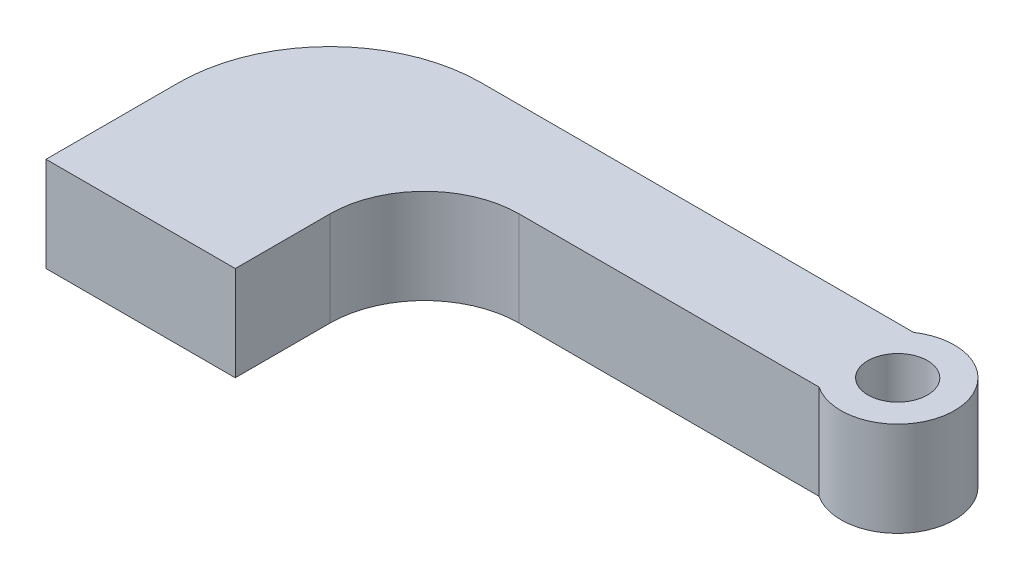
ISO-10303-21;
HEADER;
FILE_DESCRIPTION(('STEP AP214'),'2;1');
FILE_NAME('part.step','',(''),(''),'','','');
FILE_SCHEMA(('AUTOMOTIVE_DESIGN { 1 0 10303 214 1 1 1 1 }'));
ENDSEC;
DATA;
#1=APPLICATION_CONTEXT('core data for automotive mechanical design processes');
#2=APPLICATION_PROTOCOL_DEFINITION('international standard','automotive_design',2000,#1);
#3=PRODUCT_CONTEXT('',#1,'mechanical');
#4=PRODUCT('Part','Part','',(#3));
#5=PRODUCT_RELATED_PRODUCT_CATEGORY('part','',(#4));
#6=PRODUCT_DEFINITION_FORMATION('','',#4);
#7=PRODUCT_DEFINITION_CONTEXT('part definition',#1,'design');
#8=PRODUCT_DEFINITION('design','',#6,#7);
#9=PRODUCT_DEFINITION_SHAPE('','',#8);
#10=(LENGTH_UNIT() NAMED_UNIT(*) SI_UNIT(.MILLI.,.METRE.));
#11=(NAMED_UNIT(*) PLANE_ANGLE_UNIT() SI_UNIT($,.RADIAN.));
#12=(NAMED_UNIT(*) SI_UNIT($,.STERADIAN.) SOLID_ANGLE_UNIT());
#13=UNCERTAINTY_MEASURE_WITH_UNIT(LENGTH_MEASURE(1.E-05),#10,'distance_accuracy_value','');
#14=(GEOMETRIC_REPRESENTATION_CONTEXT(3) GLOBAL_UNCERTAINTY_ASSIGNED_CONTEXT((#13)) GLOBAL_UNIT_ASSIGNED_CONTEXT((#10,
#11,#12)) REPRESENTATION_CONTEXT('',''));
#15=CARTESIAN_POINT('',(0.,0.,0.));
#16=DIRECTION('',(0.,0.,1.));
#17=DIRECTION('',(1.,0.,0.));
#18=AXIS2_PLACEMENT_3D('',#15,#16,#17);
#19=CARTESIAN_POINT('',(10.16,6.35,-8.89));
#20=DIRECTION('',(0.,-1.,0.));
#21=DIRECTION('',(0.,0.,-1.));
#22=AXIS2_PLACEMENT_3D('',#19,#20,#21);
#23=PLANE('',#22);
#24=DIRECTION('',(0.,0.,1.));
#25=VECTOR('',#24,1.);
#26=CARTESIAN_POINT('',(0.,6.35,0.));
#27=LINE('',#26,#25);
#28=CARTESIAN_POINT('',(0.,6.35,-8.88999999999993));
#29=VERTEX_POINT('',#28);
#30=CARTESIAN_POINT('',(0.,6.35,0.));
#31=VERTEX_POINT('',#30);
#32=EDGE_CURVE('E145',#29,#31,#27,.T.);
#33=ORIENTED_EDGE('',*,*,#32,.T.);
#34=DIRECTION('',(1.,0.,0.));
#35=VECTOR('',#34,1.);
#36=CARTESIAN_POINT('',(0.,6.35,0.));
#37=LINE('',#36,#35);
#38=CARTESIAN_POINT('',(12.7,6.35,0.));
#39=VERTEX_POINT('',#38);
#40=EDGE_CURVE('E92',#31,#39,#37,.T.);
#41=ORIENTED_EDGE('',*,*,#40,.T.);
#42=DIRECTION('',(0.,0.,-1.));
#43=VECTOR('',#42,1.);
#44=CARTESIAN_POINT('',(12.7,6.35,0.));
#45=LINE('',#44,#43);
#46=CARTESIAN_POINT('',(12.7,6.35,-6.34999999999995));
#47=VERTEX_POINT('',#46);
#48=EDGE_CURVE('E160',#39,#47,#45,.T.);
#49=ORIENTED_EDGE('',*,*,#48,.T.);
#50=CARTESIAN_POINT('',(19.05,6.35,-6.35));
#51=DIRECTION('',(0.,-1.,0.));
#52=DIRECTION('',(0.,0.,1.));
#53=AXIS2_PLACEMENT_3D('',#50,#51,#52);
#54=CIRCLE('',#53,6.35);
#55=CARTESIAN_POINT('',(19.05,6.35,-12.7));
#56=VERTEX_POINT('',#55);
#57=EDGE_CURVE('E173',#47,#56,#54,.T.);
#58=ORIENTED_EDGE('',*,*,#57,.T.);
#59=DIRECTION('',(1.,0.,0.));
#60=VECTOR('',#59,1.);
#61=CARTESIAN_POINT('',(19.05,6.35,-12.7));
#62=LINE('',#61,#60);
#63=CARTESIAN_POINT('',(39.1688150039394,6.35,-12.7));
#64=VERTEX_POINT('',#63);
#65=EDGE_CURVE('E111',#56,#64,#62,.T.);
#66=ORIENTED_EDGE('',*,*,#65,.T.);
#67=CARTESIAN_POINT('',(41.275,6.35,-15.8749149220678));
#68=DIRECTION('',(0.,1.,0.));
#69=DIRECTION('',(0.,0.,1.));
#70=AXIS2_PLACEMENT_3D('',#67,#68,#69);
#71=CIRCLE('',#70,3.81);
#72=CARTESIAN_POINT('',(39.1690715235572,6.35,-19.05));
#73=VERTEX_POINT('',#72);
#74=EDGE_CURVE('E105',#64,#73,#71,.T.);
#75=ORIENTED_EDGE('',*,*,#74,.T.);
#76=DIRECTION('',(-1.,0.,0.));
#77=VECTOR('',#76,1.);
#78=CARTESIAN_POINT('',(12.7,6.35,-19.05));
#79=LINE('',#78,#77);
#80=CARTESIAN_POINT('',(10.1600000000001,6.35,-19.05));
#81=VERTEX_POINT('',#80);
#82=EDGE_CURVE('E109',#73,#81,#79,.T.);
#83=ORIENTED_EDGE('',*,*,#82,.T.);
#84=CARTESIAN_POINT('',(10.16,6.35,-8.89));
#85=DIRECTION('',(0.,1.,0.));
#86=DIRECTION('',(0.,0.,-1.));
#87=AXIS2_PLACEMENT_3D('',#84,#85,#86);
#88=CIRCLE('',#87,10.16);
#89=EDGE_CURVE('E50',#81,#29,#88,.T.);
#90=ORIENTED_EDGE('',*,*,#89,.T.);
#91=EDGE_LOOP('',(#33,#41,#49,#58,#66,#75,#83,#90));
#92=FACE_BOUND('',#91,.T.);
#93=CARTESIAN_POINT('',(41.275,6.35,-15.8749149220678));
#94=DIRECTION('',(0.,1.,0.));
#95=DIRECTION('',(0.,0.,1.));
#96=AXIS2_PLACEMENT_3D('',#93,#94,#95);
#97=CIRCLE('',#96,2.);
#98=CARTESIAN_POINT('',(41.275,6.35,-13.8749149220678));
#99=VERTEX_POINT('',#98);
#100=EDGE_CURVE('E134',#99,#99,#97,.T.);
#101=ORIENTED_EDGE('',*,*,#100,.F.);
#102=EDGE_LOOP('',(#101));
#103=FACE_BOUND('',#102,.T.);
#104=ADVANCED_FACE('F33',(#92,#103),#23,.F.);
#105=CARTESIAN_POINT('',(10.16,0.,-8.89));
#106=DIRECTION('',(0.,-1.,0.));
#107=DIRECTION('',(0.,0.,-1.));
#108=AXIS2_PLACEMENT_3D('',#105,#106,#107);
#109=PLANE('',#108);
#110=DIRECTION('',(0.,0.,1.));
#111=VECTOR('',#110,1.);
#112=CARTESIAN_POINT('',(0.,0.,0.));
#113=LINE('',#112,#111);
#114=CARTESIAN_POINT('',(0.,0.,-8.88999999999993));
#115=VERTEX_POINT('',#114);
#116=CARTESIAN_POINT('',(0.,0.,0.));
#117=VERTEX_POINT('',#116);
#118=EDGE_CURVE('E130',#115,#117,#113,.T.);
#119=ORIENTED_EDGE('',*,*,#118,.F.);
#120=CARTESIAN_POINT('',(10.16,0.,-8.89));
#121=DIRECTION('',(0.,1.,0.));
#122=DIRECTION('',(0.,0.,-1.));
#123=AXIS2_PLACEMENT_3D('',#120,#121,#122);
#124=CIRCLE('',#123,10.16);
#125=CARTESIAN_POINT('',(10.1600000000001,0.,-19.05));
#126=VERTEX_POINT('',#125);
#127=EDGE_CURVE('E84',#126,#115,#124,.T.);
#128=ORIENTED_EDGE('',*,*,#127,.F.);
#129=DIRECTION('',(-1.,0.,0.));
#130=VECTOR('',#129,1.);
#131=CARTESIAN_POINT('',(10.1600000000001,0.,-19.05));
#132=LINE('',#131,#130);
#133=CARTESIAN_POINT('',(39.1690715235572,0.,-19.05));
#134=VERTEX_POINT('',#133);
#135=EDGE_CURVE('E78',#134,#126,#132,.T.);
#136=ORIENTED_EDGE('',*,*,#135,.F.);
#137=CARTESIAN_POINT('',(41.275,0.,-15.8749149220678));
#138=DIRECTION('',(0.,1.,0.));
#139=DIRECTION('',(0.,0.,1.));
#140=AXIS2_PLACEMENT_3D('',#137,#138,#139);
#141=CIRCLE('',#140,3.81);
#142=CARTESIAN_POINT('',(39.1688150039394,0.,-12.7));
#143=VERTEX_POINT('',#142);
#144=EDGE_CURVE('E120',#143,#134,#141,.T.);
#145=ORIENTED_EDGE('',*,*,#144,.F.);
#146=DIRECTION('',(1.,0.,0.));
#147=VECTOR('',#146,1.);
#148=CARTESIAN_POINT('',(19.05,0.,-12.7));
#149=LINE('',#148,#147);
#150=CARTESIAN_POINT('',(19.05,0.,-12.7));
#151=VERTEX_POINT('',#150);
#152=EDGE_CURVE('E140',#151,#143,#149,.T.);
#153=ORIENTED_EDGE('',*,*,#152,.F.);
#154=CARTESIAN_POINT('',(19.05,0.,-6.35));
#155=DIRECTION('',(0.,-1.,0.));
#156=DIRECTION('',(0.,0.,1.));
#157=AXIS2_PLACEMENT_3D('',#154,#155,#156);
#158=CIRCLE('',#157,6.35);
#159=CARTESIAN_POINT('',(12.7,0.,-6.34999999999995));
#160=VERTEX_POINT('',#159);
#161=EDGE_CURVE('E138',#160,#151,#158,.T.);
#162=ORIENTED_EDGE('',*,*,#161,.F.);
#163=DIRECTION('',(0.,0.,-1.));
#164=VECTOR('',#163,1.);
#165=CARTESIAN_POINT('',(12.7,0.,0.));
#166=LINE('',#165,#164);
#167=CARTESIAN_POINT('',(12.7,0.,0.));
#168=VERTEX_POINT('',#167);
#169=EDGE_CURVE('E136',#168,#160,#166,.T.);
#170=ORIENTED_EDGE('',*,*,#169,.F.);
#171=DIRECTION('',(1.,0.,0.));
#172=VECTOR('',#171,1.);
#173=CARTESIAN_POINT('',(0.,0.,0.));
#174=LINE('',#173,#172);
#175=EDGE_CURVE('E133',#117,#168,#174,.T.);
#176=ORIENTED_EDGE('',*,*,#175,.F.);
#177=EDGE_LOOP('',(#119,#128,#136,#145,#153,#162,#170,#176));
#178=FACE_BOUND('',#177,.T.);
#179=CARTESIAN_POINT('',(41.275,0.,-15.8749149220678));
#180=DIRECTION('',(0.,1.,0.));
#181=DIRECTION('',(0.,0.,1.));
#182=AXIS2_PLACEMENT_3D('',#179,#180,#181);
#183=CIRCLE('',#182,2.);
#184=CARTESIAN_POINT('',(41.275,0.,-13.8749149220678));
#185=VERTEX_POINT('',#184);
#186=EDGE_CURVE('E179',#185,#185,#183,.T.);
#187=ORIENTED_EDGE('',*,*,#186,.T.);
#188=EDGE_LOOP('',(#187));
#189=FACE_BOUND('',#188,.T.);
#190=ADVANCED_FACE('F164',(#178,#189),#109,.T.);
#191=CARTESIAN_POINT('',(0.,6.35,0.));
#192=DIRECTION('',(1.,0.,0.));
#193=DIRECTION('',(0.,0.,-1.));
#194=AXIS2_PLACEMENT_3D('',#191,#192,#193);
#195=PLANE('',#194);
#196=ORIENTED_EDGE('',*,*,#118,.T.);
#197=DIRECTION('',(0.,-1.,0.));
#198=VECTOR('',#197,1.);
#199=CARTESIAN_POINT('',(0.,6.35,0.));
#200=LINE('',#199,#198);
#201=EDGE_CURVE('E11',#31,#117,#200,.T.);
#202=ORIENTED_EDGE('',*,*,#201,.F.);
#203=ORIENTED_EDGE('',*,*,#32,.F.);
#204=DIRECTION('',(0.,-1.,0.));
#205=VECTOR('',#204,1.);
#206=CARTESIAN_POINT('',(0.,6.35,-8.88999999999993));
#207=LINE('',#206,#205);
#208=EDGE_CURVE('E126',#29,#115,#207,.T.);
#209=ORIENTED_EDGE('',*,*,#208,.T.);
#210=EDGE_LOOP('',(#196,#202,#203,#209));
#211=FACE_BOUND('',#210,.T.);
#212=ADVANCED_FACE('F35',(#211),#195,.F.);
#213=CARTESIAN_POINT('',(0.,6.35,0.));
#214=DIRECTION('',(0.,0.,-1.));
#215=DIRECTION('',(-1.,0.,0.));
#216=AXIS2_PLACEMENT_3D('',#213,#214,#215);
#217=PLANE('',#216);
#218=ORIENTED_EDGE('',*,*,#175,.T.);
#219=DIRECTION('',(0.,-1.,0.));
#220=VECTOR('',#219,1.);
#221=CARTESIAN_POINT('',(12.7,6.35,0.));
#222=LINE('',#221,#220);
#223=EDGE_CURVE('E42',#39,#168,#222,.T.);
#224=ORIENTED_EDGE('',*,*,#223,.F.);
#225=ORIENTED_EDGE('',*,*,#40,.F.);
#226=ORIENTED_EDGE('',*,*,#201,.T.);
#227=EDGE_LOOP('',(#218,#224,#225,#226));
#228=FACE_BOUND('',#227,.T.);
#229=ADVANCED_FACE('F207',(#228),#217,.F.);
#230=CARTESIAN_POINT('',(12.7,6.35,0.));
#231=DIRECTION('',(-1.,0.,0.));
#232=DIRECTION('',(0.,0.,1.));
#233=AXIS2_PLACEMENT_3D('',#230,#231,#232);
#234=PLANE('',#233);
#235=ORIENTED_EDGE('',*,*,#169,.T.);
#236=DIRECTION('',(0.,-1.,0.));
#237=VECTOR('',#236,1.);
#238=CARTESIAN_POINT('',(12.7,6.35,-6.34999999999995));
#239=LINE('',#238,#237);
#240=EDGE_CURVE('E152',#47,#160,#239,.T.);
#241=ORIENTED_EDGE('',*,*,#240,.F.);
#242=ORIENTED_EDGE('',*,*,#48,.F.);
#243=ORIENTED_EDGE('',*,*,#223,.T.);
#244=EDGE_LOOP('',(#235,#241,#242,#243));
#245=FACE_BOUND('',#244,.T.);
#246=ADVANCED_FACE('F158',(#245),#234,.F.);
#247=CARTESIAN_POINT('',(19.05,6.35,-6.35));
#248=DIRECTION('',(0.,-1.,0.));
#249=DIRECTION('',(0.,0.,-1.));
#250=AXIS2_PLACEMENT_3D('',#247,#248,#249);
#251=CYLINDRICAL_SURFACE('',#250,6.35);
#252=ORIENTED_EDGE('',*,*,#161,.T.);
#253=DIRECTION('',(0.,-1.,0.));
#254=VECTOR('',#253,1.);
#255=CARTESIAN_POINT('',(19.05,6.35,-12.7));
#256=LINE('',#255,#254);
#257=EDGE_CURVE('E149',#56,#151,#256,.T.);
#258=ORIENTED_EDGE('',*,*,#257,.F.);
#259=ORIENTED_EDGE('',*,*,#57,.F.);
#260=ORIENTED_EDGE('',*,*,#240,.T.);
#261=EDGE_LOOP('',(#252,#258,#259,#260));
#262=FACE_BOUND('',#261,.T.);
#263=ADVANCED_FACE('F169',(#262),#251,.F.);
#264=CARTESIAN_POINT('',(19.05,6.35,-12.7));
#265=DIRECTION('',(0.,0.,-1.));
#266=DIRECTION('',(-1.,0.,0.));
#267=AXIS2_PLACEMENT_3D('',#264,#265,#266);
#268=PLANE('',#267);
#269=ORIENTED_EDGE('',*,*,#152,.T.);
#270=DIRECTION('',(0.,-1.,0.));
#271=VECTOR('',#270,1.);
#272=CARTESIAN_POINT('',(39.1688150039394,6.35,-12.7));
#273=LINE('',#272,#271);
#274=EDGE_CURVE('E121',#64,#143,#273,.T.);
#275=ORIENTED_EDGE('',*,*,#274,.F.);
#276=ORIENTED_EDGE('',*,*,#65,.F.);
#277=ORIENTED_EDGE('',*,*,#257,.T.);
#278=EDGE_LOOP('',(#269,#275,#276,#277));
#279=FACE_BOUND('',#278,.T.);
#280=ADVANCED_FACE('F172',(#279),#268,.F.);
#281=CARTESIAN_POINT('',(41.275,6.35,-15.8749149220678));
#282=DIRECTION('',(0.,-1.,0.));
#283=DIRECTION('',(0.,0.,-1.));
#284=AXIS2_PLACEMENT_3D('',#281,#282,#283);
#285=CYLINDRICAL_SURFACE('',#284,3.81);
#286=ORIENTED_EDGE('',*,*,#144,.T.);
#287=DIRECTION('',(0.,-1.,0.));
#288=VECTOR('',#287,1.);
#289=CARTESIAN_POINT('',(39.1690715235572,6.35,-19.05));
#290=LINE('',#289,#288);
#291=EDGE_CURVE('E117',#73,#134,#290,.T.);
#292=ORIENTED_EDGE('',*,*,#291,.F.);
#293=ORIENTED_EDGE('',*,*,#74,.F.);
#294=ORIENTED_EDGE('',*,*,#274,.T.);
#295=EDGE_LOOP('',(#286,#292,#293,#294));
#296=FACE_BOUND('',#295,.T.);
#297=ADVANCED_FACE('F118',(#296),#285,.T.);
#298=CARTESIAN_POINT('',(10.1600000000001,6.35,-19.05));
#299=DIRECTION('',(0.,0.,1.));
#300=DIRECTION('',(1.,0.,0.));
#301=AXIS2_PLACEMENT_3D('',#298,#299,#300);
#302=PLANE('',#301);
#303=ORIENTED_EDGE('',*,*,#135,.T.);
#304=DIRECTION('',(0.,-1.,0.));
#305=VECTOR('',#304,1.);
#306=CARTESIAN_POINT('',(10.1600000000001,6.35,-19.05));
#307=LINE('',#306,#305);
#308=EDGE_CURVE('E122',#81,#126,#307,.T.);
#309=ORIENTED_EDGE('',*,*,#308,.F.);
#310=ORIENTED_EDGE('',*,*,#82,.F.);
#311=ORIENTED_EDGE('',*,*,#291,.T.);
#312=EDGE_LOOP('',(#303,#309,#310,#311));
#313=FACE_BOUND('',#312,.T.);
#314=ADVANCED_FACE('F124',(#313),#302,.F.);
#315=CARTESIAN_POINT('',(10.16,6.35,-8.89));
#316=DIRECTION('',(0.,-1.,0.));
#317=DIRECTION('',(0.,0.,-1.));
#318=AXIS2_PLACEMENT_3D('',#315,#316,#317);
#319=CYLINDRICAL_SURFACE('',#318,10.16);
#320=ORIENTED_EDGE('',*,*,#127,.T.);
#321=ORIENTED_EDGE('',*,*,#208,.F.);
#322=ORIENTED_EDGE('',*,*,#89,.F.);
#323=ORIENTED_EDGE('',*,*,#308,.T.);
#324=EDGE_LOOP('',(#320,#321,#322,#323));
#325=FACE_BOUND('',#324,.T.);
#326=ADVANCED_FACE('F195',(#325),#319,.T.);
#327=CARTESIAN_POINT('',(41.275,6.35,-15.8749149220678));
#328=DIRECTION('',(0.,-1.,0.));
#329=DIRECTION('',(0.,0.,-1.));
#330=AXIS2_PLACEMENT_3D('',#327,#328,#329);
#331=CYLINDRICAL_SURFACE('',#330,2.);
#332=ORIENTED_EDGE('',*,*,#100,.T.);
#333=EDGE_LOOP('',(#332));
#334=FACE_BOUND('',#333,.T.);
#335=ORIENTED_EDGE('',*,*,#186,.F.);
#336=EDGE_LOOP('',(#335));
#337=FACE_BOUND('',#336,.T.);
#338=ADVANCED_FACE('F185',(#334,#337),#331,.F.);
#339=CLOSED_SHELL('',(#104,#190,#212,#229,#246,#263,#280,#297,#314,#326,#338));
#340=MANIFOLD_SOLID_BREP('B2',#339);
#341=ADVANCED_BREP_SHAPE_REPRESENTATION('',(#18,#340),#14);
#342=SHAPE_DEFINITION_REPRESENTATION(#9,#341);
ENDSEC;
END-ISO-10303-21;
